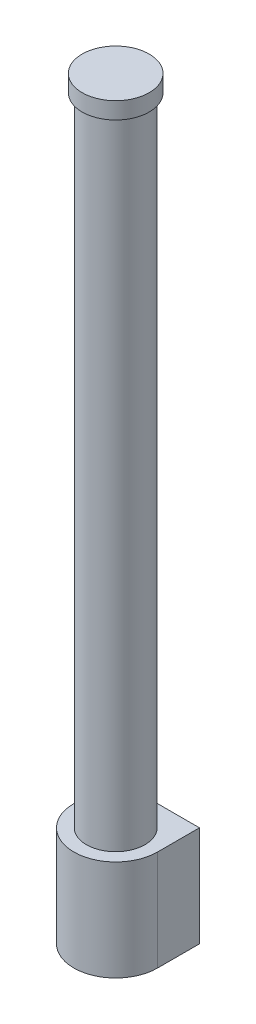
ISO-10303-21;
HEADER;
FILE_DESCRIPTION(('STEP AP214'),'2;1');
FILE_NAME('part.step','',(''),(''),'','','');
FILE_SCHEMA(('AUTOMOTIVE_DESIGN { 1 0 10303 214 1 1 1 1 }'));
ENDSEC;
DATA;
#1=APPLICATION_CONTEXT('core data for automotive mechanical design processes');
#2=APPLICATION_PROTOCOL_DEFINITION('international standard','automotive_design',2000,#1);
#3=PRODUCT_CONTEXT('',#1,'mechanical');
#4=PRODUCT('Part','Part','',(#3));
#5=PRODUCT_RELATED_PRODUCT_CATEGORY('part','',(#4));
#6=PRODUCT_DEFINITION_FORMATION('','',#4);
#7=PRODUCT_DEFINITION_CONTEXT('part definition',#1,'design');
#8=PRODUCT_DEFINITION('design','',#6,#7);
#9=PRODUCT_DEFINITION_SHAPE('','',#8);
#10=(LENGTH_UNIT() NAMED_UNIT(*) SI_UNIT(.MILLI.,.METRE.));
#11=(NAMED_UNIT(*) PLANE_ANGLE_UNIT() SI_UNIT($,.RADIAN.));
#12=(NAMED_UNIT(*) SI_UNIT($,.STERADIAN.) SOLID_ANGLE_UNIT());
#13=UNCERTAINTY_MEASURE_WITH_UNIT(LENGTH_MEASURE(1.E-05),#10,'distance_accuracy_value','');
#14=(GEOMETRIC_REPRESENTATION_CONTEXT(3) GLOBAL_UNCERTAINTY_ASSIGNED_CONTEXT((#13)) GLOBAL_UNIT_ASSIGNED_CONTEXT((#10,
#11,#12)) REPRESENTATION_CONTEXT('',''));
#15=CARTESIAN_POINT('',(0.,0.,0.));
#16=DIRECTION('',(0.,0.,1.));
#17=DIRECTION('',(1.,0.,0.));
#18=AXIS2_PLACEMENT_3D('',#15,#16,#17);
#19=CARTESIAN_POINT('',(0.,482.6,0.));
#20=DIRECTION('',(0.,-1.,0.));
#21=DIRECTION('',(0.,0.,-1.));
#22=AXIS2_PLACEMENT_3D('',#19,#20,#21);
#23=CYLINDRICAL_SURFACE('',#22,22.225);
#24=CARTESIAN_POINT('',(0.,482.6,0.));
#25=DIRECTION('',(0.,1.,0.));
#26=DIRECTION('',(0.,0.,1.));
#27=AXIS2_PLACEMENT_3D('',#24,#25,#26);
#28=CIRCLE('',#27,22.225);
#29=CARTESIAN_POINT('',(0.,482.6,22.225));
#30=VERTEX_POINT('',#29);
#31=EDGE_CURVE('E11',#30,#30,#28,.T.);
#32=ORIENTED_EDGE('',*,*,#31,.F.);
#33=EDGE_LOOP('',(#32));
#34=FACE_BOUND('',#33,.T.);
#35=CARTESIAN_POINT('',(0.,0.,0.));
#36=DIRECTION('',(0.,1.,0.));
#37=DIRECTION('',(0.,0.,1.));
#38=AXIS2_PLACEMENT_3D('',#35,#36,#37);
#39=CIRCLE('',#38,22.225);
#40=CARTESIAN_POINT('',(0.,0.,22.225));
#41=VERTEX_POINT('',#40);
#42=EDGE_CURVE('E110',#41,#41,#39,.T.);
#43=ORIENTED_EDGE('',*,*,#42,.T.);
#44=EDGE_LOOP('',(#43));
#45=FACE_BOUND('',#44,.T.);
#46=ADVANCED_FACE('F34',(#34,#45),#23,.T.);
#47=CARTESIAN_POINT('',(0.,495.3,0.));
#48=DIRECTION('',(0.,-1.,0.));
#49=DIRECTION('',(0.,0.,-1.));
#50=AXIS2_PLACEMENT_3D('',#47,#48,#49);
#51=CYLINDRICAL_SURFACE('',#50,25.4);
#52=CARTESIAN_POINT('',(0.,495.3,0.));
#53=DIRECTION('',(0.,1.,0.));
#54=DIRECTION('',(0.,0.,1.));
#55=AXIS2_PLACEMENT_3D('',#52,#53,#54);
#56=CIRCLE('',#55,25.4);
#57=CARTESIAN_POINT('',(0.,495.3,25.4));
#58=VERTEX_POINT('',#57);
#59=EDGE_CURVE('E42',#58,#58,#56,.T.);
#60=ORIENTED_EDGE('',*,*,#59,.F.);
#61=EDGE_LOOP('',(#60));
#62=FACE_BOUND('',#61,.T.);
#63=CARTESIAN_POINT('',(0.,482.6,0.));
#64=DIRECTION('',(0.,1.,0.));
#65=DIRECTION('',(0.,0.,1.));
#66=AXIS2_PLACEMENT_3D('',#63,#64,#65);
#67=CIRCLE('',#66,25.4);
#68=CARTESIAN_POINT('',(0.,482.6,25.4));
#69=VERTEX_POINT('',#68);
#70=EDGE_CURVE('E113',#69,#69,#67,.T.);
#71=ORIENTED_EDGE('',*,*,#70,.T.);
#72=EDGE_LOOP('',(#71));
#73=FACE_BOUND('',#72,.T.);
#74=ADVANCED_FACE('F118',(#62,#73),#51,.T.);
#75=CARTESIAN_POINT('',(0.,495.3,0.));
#76=DIRECTION('',(0.,1.,0.));
#77=DIRECTION('',(0.,0.,1.));
#78=AXIS2_PLACEMENT_3D('',#75,#76,#77);
#79=PLANE('',#78);
#80=ORIENTED_EDGE('',*,*,#59,.T.);
#81=EDGE_LOOP('',(#80));
#82=FACE_BOUND('',#81,.T.);
#83=ADVANCED_FACE('F123',(#82),#79,.T.);
#84=CARTESIAN_POINT('',(0.,482.6,0.));
#85=DIRECTION('',(0.,1.,0.));
#86=DIRECTION('',(0.,0.,1.));
#87=AXIS2_PLACEMENT_3D('',#84,#85,#86);
#88=PLANE('',#87);
#89=ORIENTED_EDGE('',*,*,#31,.T.);
#90=EDGE_LOOP('',(#89));
#91=FACE_BOUND('',#90,.T.);
#92=ORIENTED_EDGE('',*,*,#70,.F.);
#93=EDGE_LOOP('',(#92));
#94=FACE_BOUND('',#93,.T.);
#95=ADVANCED_FACE('F120',(#91,#94),#88,.F.);
#96=CARTESIAN_POINT('',(0.,-76.2,0.));
#97=DIRECTION('',(0.,1.,0.));
#98=DIRECTION('',(0.,0.,1.));
#99=AXIS2_PLACEMENT_3D('',#96,#97,#98);
#100=CYLINDRICAL_SURFACE('',#99,31.75);
#101=CARTESIAN_POINT('',(0.,0.,0.));
#102=DIRECTION('',(0.,-1.,0.));
#103=DIRECTION('',(0.,0.,1.));
#104=AXIS2_PLACEMENT_3D('',#101,#102,#103);
#105=CIRCLE('',#104,31.75);
#106=CARTESIAN_POINT('',(31.75,0.,0.));
#107=VERTEX_POINT('',#106);
#108=CARTESIAN_POINT('',(-31.75,0.,0.));
#109=VERTEX_POINT('',#108);
#110=EDGE_CURVE('E101',#107,#109,#105,.T.);
#111=ORIENTED_EDGE('',*,*,#110,.T.);
#112=DIRECTION('',(0.,1.,0.));
#113=VECTOR('',#112,1.);
#114=CARTESIAN_POINT('',(-31.75,-76.2,0.));
#115=LINE('',#114,#113);
#116=CARTESIAN_POINT('',(-31.75,-76.2,0.));
#117=VERTEX_POINT('',#116);
#118=EDGE_CURVE('E92',#117,#109,#115,.T.);
#119=ORIENTED_EDGE('',*,*,#118,.F.);
#120=CARTESIAN_POINT('',(0.,-76.2,0.));
#121=DIRECTION('',(0.,-1.,0.));
#122=DIRECTION('',(0.,0.,1.));
#123=AXIS2_PLACEMENT_3D('',#120,#121,#122);
#124=CIRCLE('',#123,31.75);
#125=CARTESIAN_POINT('',(31.75,-76.2,0.));
#126=VERTEX_POINT('',#125);
#127=EDGE_CURVE('E86',#126,#117,#124,.T.);
#128=ORIENTED_EDGE('',*,*,#127,.F.);
#129=DIRECTION('',(0.,1.,0.));
#130=VECTOR('',#129,1.);
#131=CARTESIAN_POINT('',(31.75,-76.2,0.));
#132=LINE('',#131,#130);
#133=EDGE_CURVE('E97',#126,#107,#132,.T.);
#134=ORIENTED_EDGE('',*,*,#133,.T.);
#135=EDGE_LOOP('',(#111,#119,#128,#134));
#136=FACE_BOUND('',#135,.T.);
#137=ADVANCED_FACE('F122',(#136),#100,.T.);
#138=CARTESIAN_POINT('',(-31.75,-76.2,0.));
#139=DIRECTION('',(1.,0.,0.));
#140=DIRECTION('',(0.,0.,-1.));
#141=AXIS2_PLACEMENT_3D('',#138,#139,#140);
#142=PLANE('',#141);
#143=DIRECTION('',(0.,0.,-1.));
#144=VECTOR('',#143,1.);
#145=CARTESIAN_POINT('',(-31.75,0.,0.));
#146=LINE('',#145,#144);
#147=CARTESIAN_POINT('',(-31.75,0.,-31.75));
#148=VERTEX_POINT('',#147);
#149=EDGE_CURVE('E91',#109,#148,#146,.T.);
#150=ORIENTED_EDGE('',*,*,#149,.T.);
#151=DIRECTION('',(0.,1.,0.));
#152=VECTOR('',#151,1.);
#153=CARTESIAN_POINT('',(-31.75,-76.2,-31.75));
#154=LINE('',#153,#152);
#155=CARTESIAN_POINT('',(-31.75,-76.2,-31.75));
#156=VERTEX_POINT('',#155);
#157=EDGE_CURVE('E89',#156,#148,#154,.T.);
#158=ORIENTED_EDGE('',*,*,#157,.F.);
#159=DIRECTION('',(0.,0.,-1.));
#160=VECTOR('',#159,1.);
#161=CARTESIAN_POINT('',(-31.75,-76.2,0.));
#162=LINE('',#161,#160);
#163=EDGE_CURVE('E81',#117,#156,#162,.T.);
#164=ORIENTED_EDGE('',*,*,#163,.F.);
#165=ORIENTED_EDGE('',*,*,#118,.T.);
#166=EDGE_LOOP('',(#150,#158,#164,#165));
#167=FACE_BOUND('',#166,.T.);
#168=ADVANCED_FACE('F90',(#167),#142,.F.);
#169=CARTESIAN_POINT('',(-31.75,-76.2,-31.75));
#170=DIRECTION('',(0.,0.,1.));
#171=DIRECTION('',(1.,0.,0.));
#172=AXIS2_PLACEMENT_3D('',#169,#170,#171);
#173=PLANE('',#172);
#174=DIRECTION('',(1.,0.,0.));
#175=VECTOR('',#174,1.);
#176=CARTESIAN_POINT('',(-31.75,0.,-31.75));
#177=LINE('',#176,#175);
#178=CARTESIAN_POINT('',(31.75,0.,-31.75));
#179=VERTEX_POINT('',#178);
#180=EDGE_CURVE('E67',#148,#179,#177,.T.);
#181=ORIENTED_EDGE('',*,*,#180,.T.);
#182=DIRECTION('',(0.,1.,0.));
#183=VECTOR('',#182,1.);
#184=CARTESIAN_POINT('',(31.75,-76.2,-31.75));
#185=LINE('',#184,#183);
#186=CARTESIAN_POINT('',(31.75,-76.2,-31.75));
#187=VERTEX_POINT('',#186);
#188=EDGE_CURVE('E93',#187,#179,#185,.T.);
#189=ORIENTED_EDGE('',*,*,#188,.F.);
#190=DIRECTION('',(1.,0.,0.));
#191=VECTOR('',#190,1.);
#192=CARTESIAN_POINT('',(-31.75,-76.2,-31.75));
#193=LINE('',#192,#191);
#194=EDGE_CURVE('E84',#156,#187,#193,.T.);
#195=ORIENTED_EDGE('',*,*,#194,.F.);
#196=ORIENTED_EDGE('',*,*,#157,.T.);
#197=EDGE_LOOP('',(#181,#189,#195,#196));
#198=FACE_BOUND('',#197,.T.);
#199=ADVANCED_FACE('F95',(#198),#173,.F.);
#200=CARTESIAN_POINT('',(31.75,-76.2,-31.75));
#201=DIRECTION('',(-1.,0.,0.));
#202=DIRECTION('',(0.,0.,1.));
#203=AXIS2_PLACEMENT_3D('',#200,#201,#202);
#204=PLANE('',#203);
#205=DIRECTION('',(0.,0.,1.));
#206=VECTOR('',#205,1.);
#207=CARTESIAN_POINT('',(31.75,0.,-31.75));
#208=LINE('',#207,#206);
#209=EDGE_CURVE('E73',#179,#107,#208,.T.);
#210=ORIENTED_EDGE('',*,*,#209,.T.);
#211=ORIENTED_EDGE('',*,*,#133,.F.);
#212=DIRECTION('',(0.,0.,1.));
#213=VECTOR('',#212,1.);
#214=CARTESIAN_POINT('',(31.75,-76.2,-31.75));
#215=LINE('',#214,#213);
#216=EDGE_CURVE('E50',#187,#126,#215,.T.);
#217=ORIENTED_EDGE('',*,*,#216,.F.);
#218=ORIENTED_EDGE('',*,*,#188,.T.);
#219=EDGE_LOOP('',(#210,#211,#217,#218));
#220=FACE_BOUND('',#219,.T.);
#221=ADVANCED_FACE('F149',(#220),#204,.F.);
#222=CARTESIAN_POINT('',(0.,-76.2,0.));
#223=DIRECTION('',(0.,1.,0.));
#224=DIRECTION('',(0.,0.,1.));
#225=AXIS2_PLACEMENT_3D('',#222,#223,#224);
#226=PLANE('',#225);
#227=ORIENTED_EDGE('',*,*,#127,.T.);
#228=ORIENTED_EDGE('',*,*,#163,.T.);
#229=ORIENTED_EDGE('',*,*,#194,.T.);
#230=ORIENTED_EDGE('',*,*,#216,.T.);
#231=EDGE_LOOP('',(#227,#228,#229,#230));
#232=FACE_BOUND('',#231,.T.);
#233=ADVANCED_FACE('F82',(#232),#226,.F.);
#234=CARTESIAN_POINT('',(0.,0.,0.));
#235=DIRECTION('',(0.,1.,0.));
#236=DIRECTION('',(0.,0.,1.));
#237=AXIS2_PLACEMENT_3D('',#234,#235,#236);
#238=PLANE('',#237);
#239=ORIENTED_EDGE('',*,*,#42,.F.);
#240=EDGE_LOOP('',(#239));
#241=FACE_BOUND('',#240,.T.);
#242=ORIENTED_EDGE('',*,*,#110,.F.);
#243=ORIENTED_EDGE('',*,*,#209,.F.);
#244=ORIENTED_EDGE('',*,*,#180,.F.);
#245=ORIENTED_EDGE('',*,*,#149,.F.);
#246=EDGE_LOOP('',(#242,#243,#244,#245));
#247=FACE_BOUND('',#246,.T.);
#248=ADVANCED_FACE('F144',(#241,#247),#238,.T.);
#249=CLOSED_SHELL('',(#46,#74,#83,#95,#137,#168,#199,#221,#233,#248));
#250=MANIFOLD_SOLID_BREP('B2',#249);
#251=ADVANCED_BREP_SHAPE_REPRESENTATION('',(#18,#250),#14);
#252=SHAPE_DEFINITION_REPRESENTATION(#9,#251);
ENDSEC;
END-ISO-10303-21;
